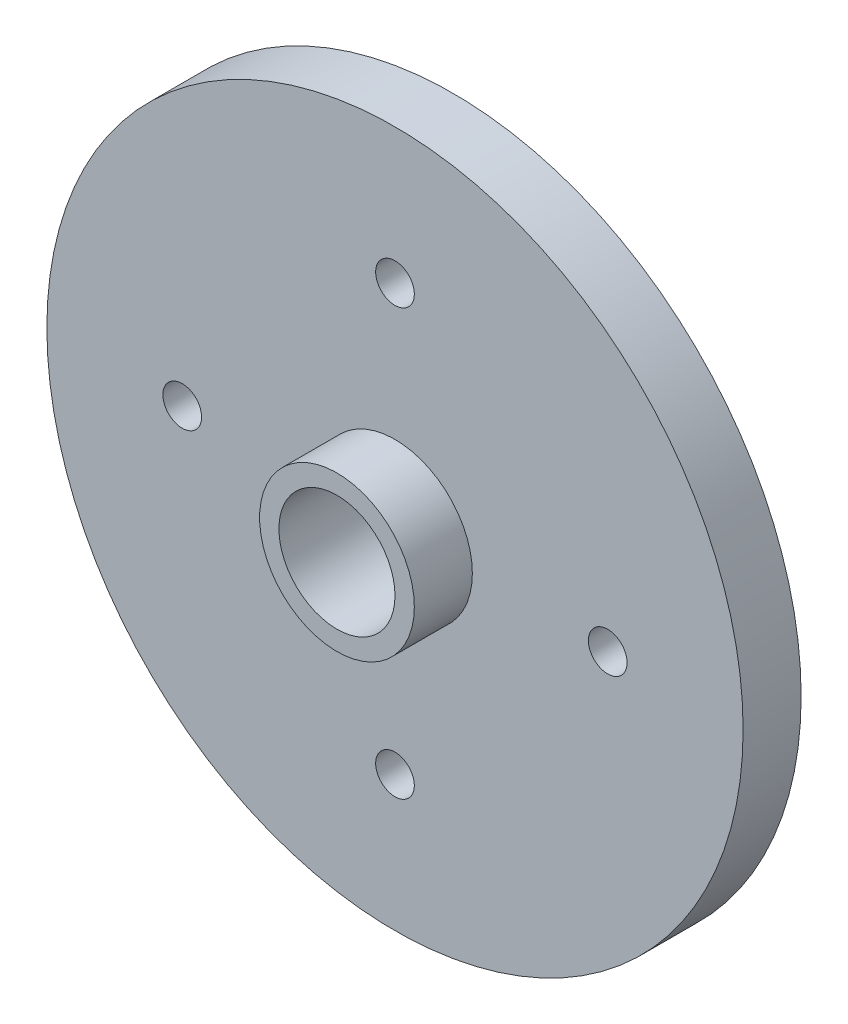
ISO-10303-21;
HEADER;
FILE_DESCRIPTION(('STEP AP214'),'2;1');
FILE_NAME('part.step','',(''),(''),'','','');
FILE_SCHEMA(('AUTOMOTIVE_DESIGN { 1 0 10303 214 1 1 1 1 }'));
ENDSEC;
DATA;
#1=APPLICATION_CONTEXT('core data for automotive mechanical design processes');
#2=APPLICATION_PROTOCOL_DEFINITION('international standard','automotive_design',2000,#1);
#3=PRODUCT_CONTEXT('',#1,'mechanical');
#4=PRODUCT('Part','Part','',(#3));
#5=PRODUCT_RELATED_PRODUCT_CATEGORY('part','',(#4));
#6=PRODUCT_DEFINITION_FORMATION('','',#4);
#7=PRODUCT_DEFINITION_CONTEXT('part definition',#1,'design');
#8=PRODUCT_DEFINITION('design','',#6,#7);
#9=PRODUCT_DEFINITION_SHAPE('','',#8);
#10=(LENGTH_UNIT() NAMED_UNIT(*) SI_UNIT(.MILLI.,.METRE.));
#11=(NAMED_UNIT(*) PLANE_ANGLE_UNIT() SI_UNIT($,.RADIAN.));
#12=(NAMED_UNIT(*) SI_UNIT($,.STERADIAN.) SOLID_ANGLE_UNIT());
#13=UNCERTAINTY_MEASURE_WITH_UNIT(LENGTH_MEASURE(1.E-05),#10,'distance_accuracy_value','');
#14=(GEOMETRIC_REPRESENTATION_CONTEXT(3) GLOBAL_UNCERTAINTY_ASSIGNED_CONTEXT((#13)) GLOBAL_UNIT_ASSIGNED_CONTEXT((#10,
#11,#12)) REPRESENTATION_CONTEXT('',''));
#15=CARTESIAN_POINT('',(0.,0.,0.));
#16=DIRECTION('',(0.,0.,1.));
#17=DIRECTION('',(1.,0.,0.));
#18=AXIS2_PLACEMENT_3D('',#15,#16,#17);
#19=CARTESIAN_POINT('',(0.,0.,3.));
#20=DIRECTION('',(0.,0.,1.));
#21=DIRECTION('',(1.,0.,0.));
#22=AXIS2_PLACEMENT_3D('',#19,#20,#21);
#23=PLANE('',#22);
#24=CARTESIAN_POINT('',(0.,0.,3.));
#25=DIRECTION('',(0.,0.,1.));
#26=DIRECTION('',(1.,0.,0.));
#27=AXIS2_PLACEMENT_3D('',#24,#25,#26);
#28=CIRCLE('',#27,4.);
#29=CARTESIAN_POINT('',(4.,0.,3.));
#30=VERTEX_POINT('',#29);
#31=EDGE_CURVE('E79',#30,#30,#28,.T.);
#32=ORIENTED_EDGE('',*,*,#31,.F.);
#33=EDGE_LOOP('',(#32));
#34=FACE_BOUND('',#33,.T.);
#35=CARTESIAN_POINT('',(6.21236273031702E-13,-11.,3.));
#36=DIRECTION('',(0.,0.,1.));
#37=DIRECTION('',(1.,0.,0.));
#38=AXIS2_PLACEMENT_3D('',#35,#36,#37);
#39=CIRCLE('',#38,1.00000000000067);
#40=CARTESIAN_POINT('',(1.00000000000129,-11.,3.));
#41=VERTEX_POINT('',#40);
#42=EDGE_CURVE('E64',#41,#41,#39,.T.);
#43=ORIENTED_EDGE('',*,*,#42,.F.);
#44=EDGE_LOOP('',(#43));
#45=FACE_BOUND('',#44,.T.);
#46=CARTESIAN_POINT('',(0.,11.,3.));
#47=DIRECTION('',(0.,0.,1.));
#48=DIRECTION('',(1.,0.,0.));
#49=AXIS2_PLACEMENT_3D('',#46,#47,#48);
#50=CIRCLE('',#49,1.);
#51=CARTESIAN_POINT('',(1.,11.,3.));
#52=VERTEX_POINT('',#51);
#53=EDGE_CURVE('E53',#52,#52,#50,.T.);
#54=ORIENTED_EDGE('',*,*,#53,.F.);
#55=EDGE_LOOP('',(#54));
#56=FACE_BOUND('',#55,.T.);
#57=CARTESIAN_POINT('',(0.,0.,3.));
#58=DIRECTION('',(0.,0.,1.));
#59=DIRECTION('',(1.,0.,0.));
#60=AXIS2_PLACEMENT_3D('',#57,#58,#59);
#61=CIRCLE('',#60,18.);
#62=CARTESIAN_POINT('',(18.,0.,3.));
#63=VERTEX_POINT('',#62);
#64=EDGE_CURVE('E10',#63,#63,#61,.T.);
#65=ORIENTED_EDGE('',*,*,#64,.T.);
#66=EDGE_LOOP('',(#65));
#67=FACE_BOUND('',#66,.T.);
#68=CARTESIAN_POINT('',(11.0000000000003,3.10618136515851E-13,3.));
#69=DIRECTION('',(0.,0.,1.));
#70=DIRECTION('',(1.,0.,0.));
#71=AXIS2_PLACEMENT_3D('',#68,#69,#70);
#72=CIRCLE('',#71,1.00000000000024);
#73=CARTESIAN_POINT('',(12.0000000000006,3.10618136515851E-13,3.));
#74=VERTEX_POINT('',#73);
#75=EDGE_CURVE('E58',#74,#74,#72,.T.);
#76=ORIENTED_EDGE('',*,*,#75,.F.);
#77=EDGE_LOOP('',(#76));
#78=FACE_BOUND('',#77,.T.);
#79=CARTESIAN_POINT('',(-10.9999999999997,-3.11965247994913E-13,3.));
#80=DIRECTION('',(0.,0.,1.));
#81=DIRECTION('',(1.,0.,0.));
#82=AXIS2_PLACEMENT_3D('',#79,#80,#81);
#83=CIRCLE('',#82,1.0000000000005);
#84=CARTESIAN_POINT('',(-9.99999999999919,-3.11965247994913E-13,3.));
#85=VERTEX_POINT('',#84);
#86=EDGE_CURVE('E70',#85,#85,#83,.T.);
#87=ORIENTED_EDGE('',*,*,#86,.F.);
#88=EDGE_LOOP('',(#87));
#89=FACE_BOUND('',#88,.T.);
#90=ADVANCED_FACE('F40',(#34,#45,#56,#67,#78,#89),#23,.T.);
#91=CARTESIAN_POINT('',(0.,0.,0.));
#92=DIRECTION('',(0.,0.,1.));
#93=DIRECTION('',(1.,0.,0.));
#94=AXIS2_PLACEMENT_3D('',#91,#92,#93);
#95=PLANE('',#94);
#96=CARTESIAN_POINT('',(0.,0.,0.));
#97=DIRECTION('',(0.,0.,1.));
#98=DIRECTION('',(1.,0.,0.));
#99=AXIS2_PLACEMENT_3D('',#96,#97,#98);
#100=CIRCLE('',#99,3.);
#101=CARTESIAN_POINT('',(3.,0.,0.));
#102=VERTEX_POINT('',#101);
#103=EDGE_CURVE('E44',#102,#102,#100,.T.);
#104=ORIENTED_EDGE('',*,*,#103,.T.);
#105=EDGE_LOOP('',(#104));
#106=FACE_BOUND('',#105,.T.);
#107=CARTESIAN_POINT('',(0.,0.,0.));
#108=DIRECTION('',(0.,0.,1.));
#109=DIRECTION('',(1.,0.,0.));
#110=AXIS2_PLACEMENT_3D('',#107,#108,#109);
#111=CIRCLE('',#110,18.);
#112=CARTESIAN_POINT('',(18.,0.,0.));
#113=VERTEX_POINT('',#112);
#114=EDGE_CURVE('E48',#113,#113,#111,.T.);
#115=ORIENTED_EDGE('',*,*,#114,.F.);
#116=EDGE_LOOP('',(#115));
#117=FACE_BOUND('',#116,.T.);
#118=CARTESIAN_POINT('',(0.,11.,0.));
#119=DIRECTION('',(0.,0.,1.));
#120=DIRECTION('',(1.,0.,0.));
#121=AXIS2_PLACEMENT_3D('',#118,#119,#120);
#122=CIRCLE('',#121,1.);
#123=CARTESIAN_POINT('',(1.,11.,0.));
#124=VERTEX_POINT('',#123);
#125=EDGE_CURVE('E55',#124,#124,#122,.T.);
#126=ORIENTED_EDGE('',*,*,#125,.T.);
#127=EDGE_LOOP('',(#126));
#128=FACE_BOUND('',#127,.T.);
#129=CARTESIAN_POINT('',(11.0000000000003,3.10618136515851E-13,0.));
#130=DIRECTION('',(0.,0.,1.));
#131=DIRECTION('',(1.,0.,0.));
#132=AXIS2_PLACEMENT_3D('',#129,#130,#131);
#133=CIRCLE('',#132,1.00000000000024);
#134=CARTESIAN_POINT('',(12.0000000000006,3.10618136515851E-13,0.));
#135=VERTEX_POINT('',#134);
#136=EDGE_CURVE('E61',#135,#135,#133,.T.);
#137=ORIENTED_EDGE('',*,*,#136,.T.);
#138=EDGE_LOOP('',(#137));
#139=FACE_BOUND('',#138,.T.);
#140=CARTESIAN_POINT('',(6.21236273031702E-13,-11.,0.));
#141=DIRECTION('',(0.,0.,1.));
#142=DIRECTION('',(1.,0.,0.));
#143=AXIS2_PLACEMENT_3D('',#140,#141,#142);
#144=CIRCLE('',#143,1.00000000000067);
#145=CARTESIAN_POINT('',(1.00000000000129,-11.,0.));
#146=VERTEX_POINT('',#145);
#147=EDGE_CURVE('E67',#146,#146,#144,.T.);
#148=ORIENTED_EDGE('',*,*,#147,.T.);
#149=EDGE_LOOP('',(#148));
#150=FACE_BOUND('',#149,.T.);
#151=CARTESIAN_POINT('',(-10.9999999999997,-3.11965247994913E-13,0.));
#152=DIRECTION('',(0.,0.,1.));
#153=DIRECTION('',(1.,0.,0.));
#154=AXIS2_PLACEMENT_3D('',#151,#152,#153);
#155=CIRCLE('',#154,1.0000000000005);
#156=CARTESIAN_POINT('',(-9.99999999999919,-3.11965247994913E-13,0.));
#157=VERTEX_POINT('',#156);
#158=EDGE_CURVE('E73',#157,#157,#155,.T.);
#159=ORIENTED_EDGE('',*,*,#158,.T.);
#160=EDGE_LOOP('',(#159));
#161=FACE_BOUND('',#160,.T.);
#162=ADVANCED_FACE('F91',(#106,#117,#128,#139,#150,#161),#95,.F.);
#163=CARTESIAN_POINT('',(0.,0.,3.));
#164=DIRECTION('',(0.,0.,-1.));
#165=DIRECTION('',(-1.,0.,0.));
#166=AXIS2_PLACEMENT_3D('',#163,#164,#165);
#167=CYLINDRICAL_SURFACE('',#166,18.);
#168=ORIENTED_EDGE('',*,*,#64,.F.);
#169=EDGE_LOOP('',(#168));
#170=FACE_BOUND('',#169,.T.);
#171=ORIENTED_EDGE('',*,*,#114,.T.);
#172=EDGE_LOOP('',(#171));
#173=FACE_BOUND('',#172,.T.);
#174=ADVANCED_FACE('F42',(#170,#173),#167,.T.);
#175=CARTESIAN_POINT('',(0.,11.,3.));
#176=DIRECTION('',(0.,0.,-1.));
#177=DIRECTION('',(-1.,0.,0.));
#178=AXIS2_PLACEMENT_3D('',#175,#176,#177);
#179=CYLINDRICAL_SURFACE('',#178,1.);
#180=ORIENTED_EDGE('',*,*,#53,.T.);
#181=EDGE_LOOP('',(#180));
#182=FACE_BOUND('',#181,.T.);
#183=ORIENTED_EDGE('',*,*,#125,.F.);
#184=EDGE_LOOP('',(#183));
#185=FACE_BOUND('',#184,.T.);
#186=ADVANCED_FACE('F114',(#182,#185),#179,.F.);
#187=CARTESIAN_POINT('',(11.0000000000003,3.10618136515851E-13,3.));
#188=DIRECTION('',(0.,0.,-1.));
#189=DIRECTION('',(-1.,0.,0.));
#190=AXIS2_PLACEMENT_3D('',#187,#188,#189);
#191=CYLINDRICAL_SURFACE('',#190,1.00000000000024);
#192=ORIENTED_EDGE('',*,*,#75,.T.);
#193=EDGE_LOOP('',(#192));
#194=FACE_BOUND('',#193,.T.);
#195=ORIENTED_EDGE('',*,*,#136,.F.);
#196=EDGE_LOOP('',(#195));
#197=FACE_BOUND('',#196,.T.);
#198=ADVANCED_FACE('F117',(#194,#197),#191,.F.);
#199=CARTESIAN_POINT('',(6.21236273031702E-13,-11.,3.));
#200=DIRECTION('',(0.,0.,-1.));
#201=DIRECTION('',(-1.,0.,0.));
#202=AXIS2_PLACEMENT_3D('',#199,#200,#201);
#203=CYLINDRICAL_SURFACE('',#202,1.00000000000067);
#204=ORIENTED_EDGE('',*,*,#42,.T.);
#205=EDGE_LOOP('',(#204));
#206=FACE_BOUND('',#205,.T.);
#207=ORIENTED_EDGE('',*,*,#147,.F.);
#208=EDGE_LOOP('',(#207));
#209=FACE_BOUND('',#208,.T.);
#210=ADVANCED_FACE('F121',(#206,#209),#203,.F.);
#211=CARTESIAN_POINT('',(-10.9999999999997,-3.11965247994913E-13,3.));
#212=DIRECTION('',(0.,0.,-1.));
#213=DIRECTION('',(-1.,0.,0.));
#214=AXIS2_PLACEMENT_3D('',#211,#212,#213);
#215=CYLINDRICAL_SURFACE('',#214,1.0000000000005);
#216=ORIENTED_EDGE('',*,*,#86,.T.);
#217=EDGE_LOOP('',(#216));
#218=FACE_BOUND('',#217,.T.);
#219=ORIENTED_EDGE('',*,*,#158,.F.);
#220=EDGE_LOOP('',(#219));
#221=FACE_BOUND('',#220,.T.);
#222=ADVANCED_FACE('F125',(#218,#221),#215,.F.);
#223=CARTESIAN_POINT('',(0.,0.,6.));
#224=DIRECTION('',(0.,0.,1.));
#225=DIRECTION('',(1.,0.,0.));
#226=AXIS2_PLACEMENT_3D('',#223,#224,#225);
#227=PLANE('',#226);
#228=CARTESIAN_POINT('',(0.,0.,6.));
#229=DIRECTION('',(0.,0.,1.));
#230=DIRECTION('',(1.,0.,0.));
#231=AXIS2_PLACEMENT_3D('',#228,#229,#230);
#232=CIRCLE('',#231,4.);
#233=CARTESIAN_POINT('',(4.,0.,6.));
#234=VERTEX_POINT('',#233);
#235=EDGE_CURVE('E76',#234,#234,#232,.T.);
#236=ORIENTED_EDGE('',*,*,#235,.T.);
#237=EDGE_LOOP('',(#236));
#238=FACE_BOUND('',#237,.T.);
#239=CARTESIAN_POINT('',(0.,0.,6.));
#240=DIRECTION('',(0.,0.,1.));
#241=DIRECTION('',(1.,0.,0.));
#242=AXIS2_PLACEMENT_3D('',#239,#240,#241);
#243=CIRCLE('',#242,3.);
#244=CARTESIAN_POINT('',(3.,0.,6.));
#245=VERTEX_POINT('',#244);
#246=EDGE_CURVE('E82',#245,#245,#243,.T.);
#247=ORIENTED_EDGE('',*,*,#246,.F.);
#248=EDGE_LOOP('',(#247));
#249=FACE_BOUND('',#248,.T.);
#250=ADVANCED_FACE('F101',(#238,#249),#227,.T.);
#251=CARTESIAN_POINT('',(0.,0.,6.));
#252=DIRECTION('',(0.,0.,-1.));
#253=DIRECTION('',(-1.,0.,0.));
#254=AXIS2_PLACEMENT_3D('',#251,#252,#253);
#255=CYLINDRICAL_SURFACE('',#254,4.);
#256=ORIENTED_EDGE('',*,*,#235,.F.);
#257=EDGE_LOOP('',(#256));
#258=FACE_BOUND('',#257,.T.);
#259=ORIENTED_EDGE('',*,*,#31,.T.);
#260=EDGE_LOOP('',(#259));
#261=FACE_BOUND('',#260,.T.);
#262=ADVANCED_FACE('F96',(#258,#261),#255,.T.);
#263=CARTESIAN_POINT('',(0.,0.,6.));
#264=DIRECTION('',(0.,0.,-1.));
#265=DIRECTION('',(-1.,0.,0.));
#266=AXIS2_PLACEMENT_3D('',#263,#264,#265);
#267=CYLINDRICAL_SURFACE('',#266,3.);
#268=ORIENTED_EDGE('',*,*,#246,.T.);
#269=EDGE_LOOP('',(#268));
#270=FACE_BOUND('',#269,.T.);
#271=ORIENTED_EDGE('',*,*,#103,.F.);
#272=EDGE_LOOP('',(#271));
#273=FACE_BOUND('',#272,.T.);
#274=ADVANCED_FACE('F94',(#270,#273),#267,.F.);
#275=CLOSED_SHELL('',(#90,#162,#174,#186,#198,#210,#222,#250,#262,#274));
#276=MANIFOLD_SOLID_BREP('B2',#275);
#277=ADVANCED_BREP_SHAPE_REPRESENTATION('',(#18,#276),#14);
#278=SHAPE_DEFINITION_REPRESENTATION(#9,#277);
ENDSEC;
END-ISO-10303-21;
